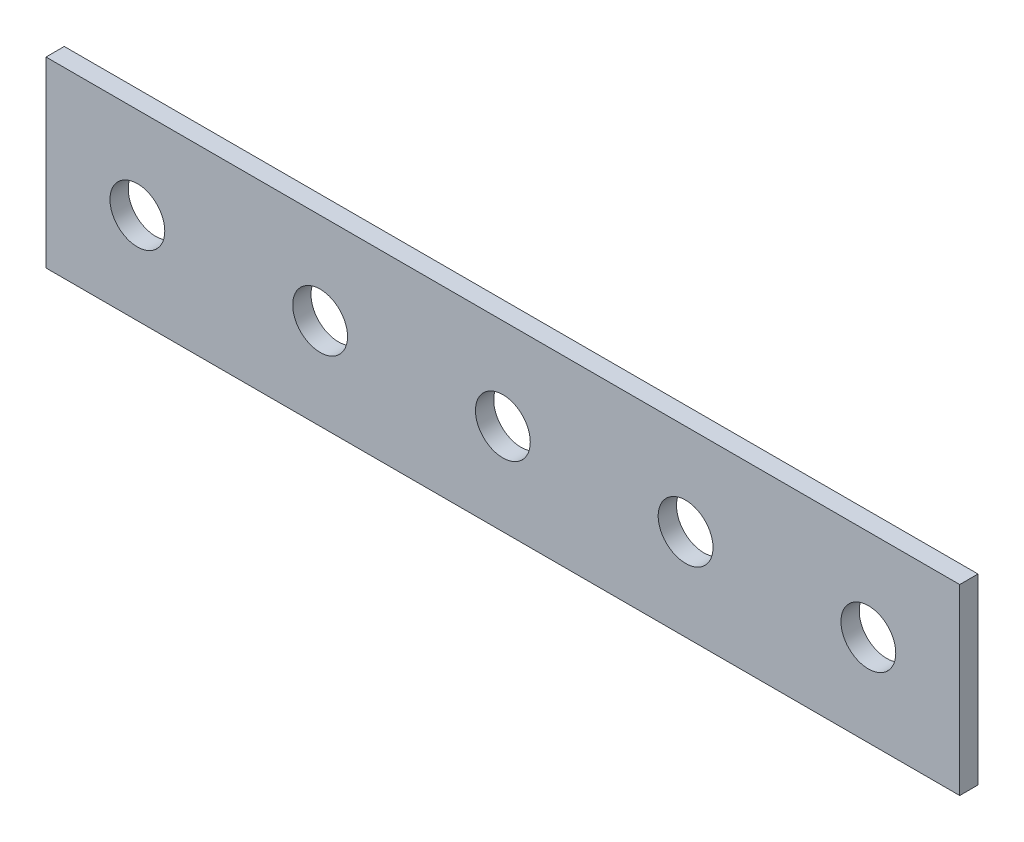
ISO-10303-21;
HEADER;
FILE_DESCRIPTION(('STEP AP214'),'2;1');
FILE_NAME('part.step','',(''),(''),'','','');
FILE_SCHEMA(('AUTOMOTIVE_DESIGN { 1 0 10303 214 1 1 1 1 }'));
ENDSEC;
DATA;
#1=APPLICATION_CONTEXT('core data for automotive mechanical design processes');
#2=APPLICATION_PROTOCOL_DEFINITION('international standard','automotive_design',2000,#1);
#3=PRODUCT_CONTEXT('',#1,'mechanical');
#4=PRODUCT('Part','Part','',(#3));
#5=PRODUCT_RELATED_PRODUCT_CATEGORY('part','',(#4));
#6=PRODUCT_DEFINITION_FORMATION('','',#4);
#7=PRODUCT_DEFINITION_CONTEXT('part definition',#1,'design');
#8=PRODUCT_DEFINITION('design','',#6,#7);
#9=PRODUCT_DEFINITION_SHAPE('','',#8);
#10=(LENGTH_UNIT() NAMED_UNIT(*) SI_UNIT(.MILLI.,.METRE.));
#11=(NAMED_UNIT(*) PLANE_ANGLE_UNIT() SI_UNIT($,.RADIAN.));
#12=(NAMED_UNIT(*) SI_UNIT($,.STERADIAN.) SOLID_ANGLE_UNIT());
#13=UNCERTAINTY_MEASURE_WITH_UNIT(LENGTH_MEASURE(1.E-05),#10,'distance_accuracy_value','');
#14=(GEOMETRIC_REPRESENTATION_CONTEXT(3) GLOBAL_UNCERTAINTY_ASSIGNED_CONTEXT((#13)) GLOBAL_UNIT_ASSIGNED_CONTEXT((#10,
#11,#12)) REPRESENTATION_CONTEXT('',''));
#15=CARTESIAN_POINT('',(0.,0.,0.));
#16=DIRECTION('',(0.,0.,1.));
#17=DIRECTION('',(1.,0.,0.));
#18=AXIS2_PLACEMENT_3D('',#15,#16,#17);
#19=CARTESIAN_POINT('',(5.00000000000002,5.,0.));
#20=DIRECTION('',(0.,0.,1.));
#21=DIRECTION('',(1.,0.,0.));
#22=AXIS2_PLACEMENT_3D('',#19,#20,#21);
#23=CYLINDRICAL_SURFACE('',#22,1.5);
#24=CARTESIAN_POINT('',(5.00000000000002,5.,0.));
#25=DIRECTION('',(0.,0.,1.));
#26=DIRECTION('',(1.,0.,0.));
#27=AXIS2_PLACEMENT_3D('',#24,#25,#26);
#28=CIRCLE('',#27,1.5);
#29=CARTESIAN_POINT('',(6.50000000000002,5.,0.));
#30=VERTEX_POINT('',#29);
#31=EDGE_CURVE('E40',#30,#30,#28,.T.);
#32=ORIENTED_EDGE('',*,*,#31,.F.);
#33=EDGE_LOOP('',(#32));
#34=FACE_BOUND('',#33,.T.);
#35=CARTESIAN_POINT('',(5.00000000000002,5.,1.));
#36=DIRECTION('',(0.,0.,1.));
#37=DIRECTION('',(1.,0.,0.));
#38=AXIS2_PLACEMENT_3D('',#35,#36,#37);
#39=CIRCLE('',#38,1.5);
#40=CARTESIAN_POINT('',(6.50000000000002,5.,1.));
#41=VERTEX_POINT('',#40);
#42=EDGE_CURVE('E11',#41,#41,#39,.T.);
#43=ORIENTED_EDGE('',*,*,#42,.T.);
#44=EDGE_LOOP('',(#43));
#45=FACE_BOUND('',#44,.T.);
#46=ADVANCED_FACE('F32',(#34,#45),#23,.F.);
#47=CARTESIAN_POINT('',(45.,5.,0.));
#48=DIRECTION('',(0.,0.,1.));
#49=DIRECTION('',(1.,0.,0.));
#50=AXIS2_PLACEMENT_3D('',#47,#48,#49);
#51=CYLINDRICAL_SURFACE('',#50,1.5);
#52=CARTESIAN_POINT('',(45.,5.,0.));
#53=DIRECTION('',(0.,0.,1.));
#54=DIRECTION('',(1.,0.,0.));
#55=AXIS2_PLACEMENT_3D('',#52,#53,#54);
#56=CIRCLE('',#55,1.5);
#57=CARTESIAN_POINT('',(46.5,5.,0.));
#58=VERTEX_POINT('',#57);
#59=EDGE_CURVE('E110',#58,#58,#56,.T.);
#60=ORIENTED_EDGE('',*,*,#59,.F.);
#61=EDGE_LOOP('',(#60));
#62=FACE_BOUND('',#61,.T.);
#63=CARTESIAN_POINT('',(45.,5.,1.));
#64=DIRECTION('',(0.,0.,1.));
#65=DIRECTION('',(1.,0.,0.));
#66=AXIS2_PLACEMENT_3D('',#63,#64,#65);
#67=CIRCLE('',#66,1.5);
#68=CARTESIAN_POINT('',(46.5,5.,1.));
#69=VERTEX_POINT('',#68);
#70=EDGE_CURVE('E113',#69,#69,#67,.T.);
#71=ORIENTED_EDGE('',*,*,#70,.T.);
#72=EDGE_LOOP('',(#71));
#73=FACE_BOUND('',#72,.T.);
#74=ADVANCED_FACE('F122',(#62,#73),#51,.F.);
#75=CARTESIAN_POINT('',(0.,0.,1.));
#76=DIRECTION('',(1.,0.,0.));
#77=DIRECTION('',(0.,0.,-1.));
#78=AXIS2_PLACEMENT_3D('',#75,#76,#77);
#79=PLANE('',#78);
#80=DIRECTION('',(0.,-1.,0.));
#81=VECTOR('',#80,1.);
#82=CARTESIAN_POINT('',(0.,0.,0.));
#83=LINE('',#82,#81);
#84=CARTESIAN_POINT('',(0.,10.,0.));
#85=VERTEX_POINT('',#84);
#86=CARTESIAN_POINT('',(0.,0.,0.));
#87=VERTEX_POINT('',#86);
#88=EDGE_CURVE('E100',#85,#87,#83,.T.);
#89=ORIENTED_EDGE('',*,*,#88,.T.);
#90=DIRECTION('',(0.,0.,-1.));
#91=VECTOR('',#90,1.);
#92=CARTESIAN_POINT('',(0.,0.,1.));
#93=LINE('',#92,#91);
#94=CARTESIAN_POINT('',(0.,0.,1.));
#95=VERTEX_POINT('',#94);
#96=EDGE_CURVE('E91',#95,#87,#93,.T.);
#97=ORIENTED_EDGE('',*,*,#96,.F.);
#98=DIRECTION('',(0.,-1.,0.));
#99=VECTOR('',#98,1.);
#100=CARTESIAN_POINT('',(0.,0.,1.));
#101=LINE('',#100,#99);
#102=CARTESIAN_POINT('',(0.,10.,1.));
#103=VERTEX_POINT('',#102);
#104=EDGE_CURVE('E85',#103,#95,#101,.T.);
#105=ORIENTED_EDGE('',*,*,#104,.F.);
#106=DIRECTION('',(0.,0.,-1.));
#107=VECTOR('',#106,1.);
#108=CARTESIAN_POINT('',(0.,10.,1.));
#109=LINE('',#108,#107);
#110=EDGE_CURVE('E96',#103,#85,#109,.T.);
#111=ORIENTED_EDGE('',*,*,#110,.T.);
#112=EDGE_LOOP('',(#89,#97,#105,#111));
#113=FACE_BOUND('',#112,.T.);
#114=ADVANCED_FACE('F146',(#113),#79,.F.);
#115=CARTESIAN_POINT('',(0.,0.,1.));
#116=DIRECTION('',(0.,1.,0.));
#117=DIRECTION('',(0.,0.,1.));
#118=AXIS2_PLACEMENT_3D('',#115,#116,#117);
#119=PLANE('',#118);
#120=DIRECTION('',(1.,0.,0.));
#121=VECTOR('',#120,1.);
#122=CARTESIAN_POINT('',(0.,0.,0.));
#123=LINE('',#122,#121);
#124=CARTESIAN_POINT('',(50.,0.,0.));
#125=VERTEX_POINT('',#124);
#126=EDGE_CURVE('E90',#87,#125,#123,.T.);
#127=ORIENTED_EDGE('',*,*,#126,.T.);
#128=DIRECTION('',(0.,0.,-1.));
#129=VECTOR('',#128,1.);
#130=CARTESIAN_POINT('',(50.,0.,1.));
#131=LINE('',#130,#129);
#132=CARTESIAN_POINT('',(50.,0.,1.));
#133=VERTEX_POINT('',#132);
#134=EDGE_CURVE('E88',#133,#125,#131,.T.);
#135=ORIENTED_EDGE('',*,*,#134,.F.);
#136=DIRECTION('',(1.,0.,0.));
#137=VECTOR('',#136,1.);
#138=CARTESIAN_POINT('',(0.,0.,1.));
#139=LINE('',#138,#137);
#140=EDGE_CURVE('E79',#95,#133,#139,.T.);
#141=ORIENTED_EDGE('',*,*,#140,.F.);
#142=ORIENTED_EDGE('',*,*,#96,.T.);
#143=EDGE_LOOP('',(#127,#135,#141,#142));
#144=FACE_BOUND('',#143,.T.);
#145=ADVANCED_FACE('F89',(#144),#119,.F.);
#146=CARTESIAN_POINT('',(50.,0.,1.));
#147=DIRECTION('',(-1.,0.,0.));
#148=DIRECTION('',(0.,0.,1.));
#149=AXIS2_PLACEMENT_3D('',#146,#147,#148);
#150=PLANE('',#149);
#151=DIRECTION('',(0.,1.,0.));
#152=VECTOR('',#151,1.);
#153=CARTESIAN_POINT('',(50.,0.,0.));
#154=LINE('',#153,#152);
#155=CARTESIAN_POINT('',(50.,10.,0.));
#156=VERTEX_POINT('',#155);
#157=EDGE_CURVE('E65',#125,#156,#154,.T.);
#158=ORIENTED_EDGE('',*,*,#157,.T.);
#159=DIRECTION('',(0.,0.,-1.));
#160=VECTOR('',#159,1.);
#161=CARTESIAN_POINT('',(50.,10.,1.));
#162=LINE('',#161,#160);
#163=CARTESIAN_POINT('',(50.,10.,1.));
#164=VERTEX_POINT('',#163);
#165=EDGE_CURVE('E92',#164,#156,#162,.T.);
#166=ORIENTED_EDGE('',*,*,#165,.F.);
#167=DIRECTION('',(0.,1.,0.));
#168=VECTOR('',#167,1.);
#169=CARTESIAN_POINT('',(50.,0.,1.));
#170=LINE('',#169,#168);
#171=EDGE_CURVE('E83',#133,#164,#170,.T.);
#172=ORIENTED_EDGE('',*,*,#171,.F.);
#173=ORIENTED_EDGE('',*,*,#134,.T.);
#174=EDGE_LOOP('',(#158,#166,#172,#173));
#175=FACE_BOUND('',#174,.T.);
#176=ADVANCED_FACE('F94',(#175),#150,.F.);
#177=CARTESIAN_POINT('',(0.,10.,1.));
#178=DIRECTION('',(0.,-1.,0.));
#179=DIRECTION('',(0.,0.,-1.));
#180=AXIS2_PLACEMENT_3D('',#177,#178,#179);
#181=PLANE('',#180);
#182=DIRECTION('',(-1.,0.,0.));
#183=VECTOR('',#182,1.);
#184=CARTESIAN_POINT('',(0.,10.,0.));
#185=LINE('',#184,#183);
#186=EDGE_CURVE('E71',#156,#85,#185,.T.);
#187=ORIENTED_EDGE('',*,*,#186,.T.);
#188=ORIENTED_EDGE('',*,*,#110,.F.);
#189=DIRECTION('',(-1.,0.,0.));
#190=VECTOR('',#189,1.);
#191=CARTESIAN_POINT('',(0.,10.,1.));
#192=LINE('',#191,#190);
#193=EDGE_CURVE('E48',#164,#103,#192,.T.);
#194=ORIENTED_EDGE('',*,*,#193,.F.);
#195=ORIENTED_EDGE('',*,*,#165,.T.);
#196=EDGE_LOOP('',(#187,#188,#194,#195));
#197=FACE_BOUND('',#196,.T.);
#198=ADVANCED_FACE('F126',(#197),#181,.F.);
#199=CARTESIAN_POINT('',(0.,0.,1.));
#200=DIRECTION('',(0.,0.,-1.));
#201=DIRECTION('',(-1.,0.,0.));
#202=AXIS2_PLACEMENT_3D('',#199,#200,#201);
#203=PLANE('',#202);
#204=CARTESIAN_POINT('',(15.,5.,1.));
#205=DIRECTION('',(0.,0.,1.));
#206=DIRECTION('',(1.,0.,0.));
#207=AXIS2_PLACEMENT_3D('',#204,#205,#206);
#208=CIRCLE('',#207,1.5);
#209=CARTESIAN_POINT('',(16.5,5.,1.));
#210=VERTEX_POINT('',#209);
#211=EDGE_CURVE('E227',#210,#210,#208,.T.);
#212=ORIENTED_EDGE('',*,*,#211,.F.);
#213=EDGE_LOOP('',(#212));
#214=FACE_BOUND('',#213,.T.);
#215=CARTESIAN_POINT('',(35.,5.,1.));
#216=DIRECTION('',(0.,0.,1.));
#217=DIRECTION('',(1.,0.,0.));
#218=AXIS2_PLACEMENT_3D('',#215,#216,#217);
#219=CIRCLE('',#218,1.5);
#220=CARTESIAN_POINT('',(36.5,5.,1.));
#221=VERTEX_POINT('',#220);
#222=EDGE_CURVE('E231',#221,#221,#219,.T.);
#223=ORIENTED_EDGE('',*,*,#222,.F.);
#224=EDGE_LOOP('',(#223));
#225=FACE_BOUND('',#224,.T.);
#226=CARTESIAN_POINT('',(25.,5.,1.));
#227=DIRECTION('',(0.,0.,1.));
#228=DIRECTION('',(1.,0.,0.));
#229=AXIS2_PLACEMENT_3D('',#226,#227,#228);
#230=CIRCLE('',#229,1.5);
#231=CARTESIAN_POINT('',(26.5,5.,1.));
#232=VERTEX_POINT('',#231);
#233=EDGE_CURVE('E237',#232,#232,#230,.T.);
#234=ORIENTED_EDGE('',*,*,#233,.F.);
#235=EDGE_LOOP('',(#234));
#236=FACE_BOUND('',#235,.T.);
#237=ORIENTED_EDGE('',*,*,#104,.T.);
#238=ORIENTED_EDGE('',*,*,#140,.T.);
#239=ORIENTED_EDGE('',*,*,#171,.T.);
#240=ORIENTED_EDGE('',*,*,#193,.T.);
#241=EDGE_LOOP('',(#237,#238,#239,#240));
#242=FACE_BOUND('',#241,.T.);
#243=ORIENTED_EDGE('',*,*,#70,.F.);
#244=EDGE_LOOP('',(#243));
#245=FACE_BOUND('',#244,.T.);
#246=ORIENTED_EDGE('',*,*,#42,.F.);
#247=EDGE_LOOP('',(#246));
#248=FACE_BOUND('',#247,.T.);
#249=ADVANCED_FACE('F80',(#214,#225,#236,#242,#245,#248),#203,.F.);
#250=CARTESIAN_POINT('',(0.,0.,0.));
#251=DIRECTION('',(0.,0.,-1.));
#252=DIRECTION('',(-1.,0.,0.));
#253=AXIS2_PLACEMENT_3D('',#250,#251,#252);
#254=PLANE('',#253);
#255=CARTESIAN_POINT('',(15.,5.,0.));
#256=DIRECTION('',(0.,0.,1.));
#257=DIRECTION('',(1.,0.,0.));
#258=AXIS2_PLACEMENT_3D('',#255,#256,#257);
#259=CIRCLE('',#258,1.5);
#260=CARTESIAN_POINT('',(16.5,5.,0.));
#261=VERTEX_POINT('',#260);
#262=EDGE_CURVE('E225',#261,#261,#259,.T.);
#263=ORIENTED_EDGE('',*,*,#262,.T.);
#264=EDGE_LOOP('',(#263));
#265=FACE_BOUND('',#264,.T.);
#266=CARTESIAN_POINT('',(35.,5.,0.));
#267=DIRECTION('',(0.,0.,1.));
#268=DIRECTION('',(1.,0.,0.));
#269=AXIS2_PLACEMENT_3D('',#266,#267,#268);
#270=CIRCLE('',#269,1.5);
#271=CARTESIAN_POINT('',(36.5,5.,0.));
#272=VERTEX_POINT('',#271);
#273=EDGE_CURVE('E228',#272,#272,#270,.T.);
#274=ORIENTED_EDGE('',*,*,#273,.T.);
#275=EDGE_LOOP('',(#274));
#276=FACE_BOUND('',#275,.T.);
#277=CARTESIAN_POINT('',(25.,5.,0.));
#278=DIRECTION('',(0.,0.,1.));
#279=DIRECTION('',(1.,0.,0.));
#280=AXIS2_PLACEMENT_3D('',#277,#278,#279);
#281=CIRCLE('',#280,1.5);
#282=CARTESIAN_POINT('',(26.5,5.,0.));
#283=VERTEX_POINT('',#282);
#284=EDGE_CURVE('E103',#283,#283,#281,.T.);
#285=ORIENTED_EDGE('',*,*,#284,.T.);
#286=EDGE_LOOP('',(#285));
#287=FACE_BOUND('',#286,.T.);
#288=ORIENTED_EDGE('',*,*,#88,.F.);
#289=ORIENTED_EDGE('',*,*,#186,.F.);
#290=ORIENTED_EDGE('',*,*,#157,.F.);
#291=ORIENTED_EDGE('',*,*,#126,.F.);
#292=EDGE_LOOP('',(#288,#289,#290,#291));
#293=FACE_BOUND('',#292,.T.);
#294=ORIENTED_EDGE('',*,*,#59,.T.);
#295=EDGE_LOOP('',(#294));
#296=FACE_BOUND('',#295,.T.);
#297=ORIENTED_EDGE('',*,*,#31,.T.);
#298=EDGE_LOOP('',(#297));
#299=FACE_BOUND('',#298,.T.);
#300=ADVANCED_FACE('F118',(#265,#276,#287,#293,#296,#299),#254,.T.);
#301=CARTESIAN_POINT('',(25.,5.,0.));
#302=DIRECTION('',(0.,0.,1.));
#303=DIRECTION('',(1.,0.,0.));
#304=AXIS2_PLACEMENT_3D('',#301,#302,#303);
#305=CYLINDRICAL_SURFACE('',#304,1.5);
#306=ORIENTED_EDGE('',*,*,#284,.F.);
#307=EDGE_LOOP('',(#306));
#308=FACE_BOUND('',#307,.T.);
#309=ORIENTED_EDGE('',*,*,#233,.T.);
#310=EDGE_LOOP('',(#309));
#311=FACE_BOUND('',#310,.T.);
#312=ADVANCED_FACE('F133',(#308,#311),#305,.F.);
#313=CARTESIAN_POINT('',(35.,5.,0.));
#314=DIRECTION('',(0.,0.,1.));
#315=DIRECTION('',(1.,0.,0.));
#316=AXIS2_PLACEMENT_3D('',#313,#314,#315);
#317=CYLINDRICAL_SURFACE('',#316,1.5);
#318=ORIENTED_EDGE('',*,*,#273,.F.);
#319=EDGE_LOOP('',(#318));
#320=FACE_BOUND('',#319,.T.);
#321=ORIENTED_EDGE('',*,*,#222,.T.);
#322=EDGE_LOOP('',(#321));
#323=FACE_BOUND('',#322,.T.);
#324=ADVANCED_FACE('F185',(#320,#323),#317,.F.);
#325=CARTESIAN_POINT('',(15.,5.,0.));
#326=DIRECTION('',(0.,0.,1.));
#327=DIRECTION('',(1.,0.,0.));
#328=AXIS2_PLACEMENT_3D('',#325,#326,#327);
#329=CYLINDRICAL_SURFACE('',#328,1.5);
#330=ORIENTED_EDGE('',*,*,#262,.F.);
#331=EDGE_LOOP('',(#330));
#332=FACE_BOUND('',#331,.T.);
#333=ORIENTED_EDGE('',*,*,#211,.T.);
#334=EDGE_LOOP('',(#333));
#335=FACE_BOUND('',#334,.T.);
#336=ADVANCED_FACE('F196',(#332,#335),#329,.F.);
#337=CLOSED_SHELL('',(#46,#74,#114,#145,#176,#198,#249,#300,#312,#324,#336));
#338=MANIFOLD_SOLID_BREP('B2',#337);
#339=ADVANCED_BREP_SHAPE_REPRESENTATION('',(#18,#338),#14);
#340=SHAPE_DEFINITION_REPRESENTATION(#9,#339);
ENDSEC;
END-ISO-10303-21;
